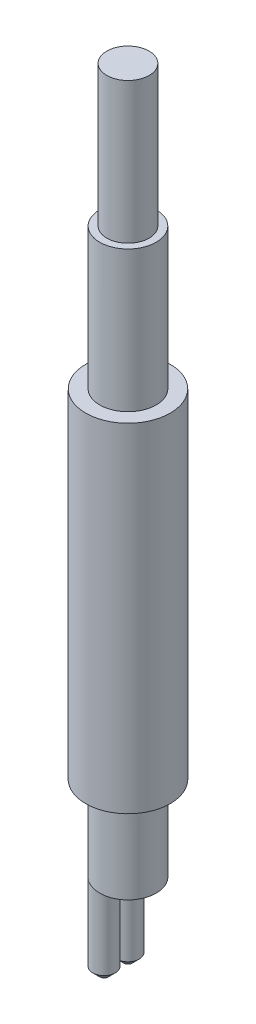
ISO-10303-21;
HEADER;
FILE_DESCRIPTION(('STEP AP214'),'2;1');
FILE_NAME('part.step','',(''),(''),'','','');
FILE_SCHEMA(('AUTOMOTIVE_DESIGN { 1 0 10303 214 1 1 1 1 }'));
ENDSEC;
DATA;
#1=APPLICATION_CONTEXT('core data for automotive mechanical design processes');
#2=APPLICATION_PROTOCOL_DEFINITION('international standard','automotive_design',2000,#1);
#3=PRODUCT_CONTEXT('',#1,'mechanical');
#4=PRODUCT('Part','Part','',(#3));
#5=PRODUCT_RELATED_PRODUCT_CATEGORY('part','',(#4));
#6=PRODUCT_DEFINITION_FORMATION('','',#4);
#7=PRODUCT_DEFINITION_CONTEXT('part definition',#1,'design');
#8=PRODUCT_DEFINITION('design','',#6,#7);
#9=PRODUCT_DEFINITION_SHAPE('','',#8);
#10=(LENGTH_UNIT() NAMED_UNIT(*) SI_UNIT(.MILLI.,.METRE.));
#11=(NAMED_UNIT(*) PLANE_ANGLE_UNIT() SI_UNIT($,.RADIAN.));
#12=(NAMED_UNIT(*) SI_UNIT($,.STERADIAN.) SOLID_ANGLE_UNIT());
#13=UNCERTAINTY_MEASURE_WITH_UNIT(LENGTH_MEASURE(1.E-05),#10,'distance_accuracy_value','');
#14=(GEOMETRIC_REPRESENTATION_CONTEXT(3) GLOBAL_UNCERTAINTY_ASSIGNED_CONTEXT((#13)) GLOBAL_UNIT_ASSIGNED_CONTEXT((#10,
#11,#12)) REPRESENTATION_CONTEXT('',''));
#15=CARTESIAN_POINT('',(0.,0.,0.));
#16=DIRECTION('',(0.,0.,1.));
#17=DIRECTION('',(1.,0.,0.));
#18=AXIS2_PLACEMENT_3D('',#15,#16,#17);
#19=CARTESIAN_POINT('',(0.,15.,0.));
#20=DIRECTION('',(0.,1.,0.));
#21=DIRECTION('',(0.,0.,1.));
#22=AXIS2_PLACEMENT_3D('',#19,#20,#21);
#23=PLANE('',#22);
#24=CARTESIAN_POINT('',(0.,15.,0.));
#25=DIRECTION('',(0.,1.,0.));
#26=DIRECTION('',(0.,0.,1.));
#27=AXIS2_PLACEMENT_3D('',#24,#25,#26);
#28=CIRCLE('',#27,1.5);
#29=CARTESIAN_POINT('',(0.,15.,1.5));
#30=VERTEX_POINT('',#29);
#31=EDGE_CURVE('E12',#30,#30,#28,.T.);
#32=ORIENTED_EDGE('',*,*,#31,.T.);
#33=EDGE_LOOP('',(#32));
#34=FACE_BOUND('',#33,.T.);
#35=CARTESIAN_POINT('',(0.,15.,0.));
#36=DIRECTION('',(0.,1.,0.));
#37=DIRECTION('',(1.,0.,0.));
#38=AXIS2_PLACEMENT_3D('',#35,#36,#37);
#39=CIRCLE('',#38,1.);
#40=CARTESIAN_POINT('',(1.,15.,0.));
#41=VERTEX_POINT('',#40);
#42=EDGE_CURVE('E62',#41,#41,#39,.T.);
#43=ORIENTED_EDGE('',*,*,#42,.F.);
#44=EDGE_LOOP('',(#43));
#45=FACE_BOUND('',#44,.T.);
#46=ADVANCED_FACE('F51',(#34,#45),#23,.T.);
#47=CARTESIAN_POINT('',(0.,3.,0.));
#48=DIRECTION('',(0.,1.,0.));
#49=DIRECTION('',(0.,0.,1.));
#50=AXIS2_PLACEMENT_3D('',#47,#48,#49);
#51=PLANE('',#50);
#52=CARTESIAN_POINT('',(0.,3.,0.));
#53=DIRECTION('',(0.,1.,0.));
#54=DIRECTION('',(0.,0.,1.));
#55=AXIS2_PLACEMENT_3D('',#52,#53,#54);
#56=CIRCLE('',#55,1.5);
#57=CARTESIAN_POINT('',(0.,3.,1.5));
#58=VERTEX_POINT('',#57);
#59=EDGE_CURVE('E55',#58,#58,#56,.T.);
#60=ORIENTED_EDGE('',*,*,#59,.F.);
#61=EDGE_LOOP('',(#60));
#62=FACE_BOUND('',#61,.T.);
#63=CARTESIAN_POINT('',(0.,3.,0.));
#64=DIRECTION('',(0.,1.,0.));
#65=DIRECTION('',(1.,0.,0.));
#66=AXIS2_PLACEMENT_3D('',#63,#64,#65);
#67=CIRCLE('',#66,1.);
#68=CARTESIAN_POINT('',(1.,3.,0.));
#69=VERTEX_POINT('',#68);
#70=EDGE_CURVE('E64',#69,#69,#67,.T.);
#71=ORIENTED_EDGE('',*,*,#70,.T.);
#72=EDGE_LOOP('',(#71));
#73=FACE_BOUND('',#72,.T.);
#74=ADVANCED_FACE('F74',(#62,#73),#51,.F.);
#75=CARTESIAN_POINT('',(0.,15.,0.));
#76=DIRECTION('',(0.,-1.,0.));
#77=DIRECTION('',(0.,0.,-1.));
#78=AXIS2_PLACEMENT_3D('',#75,#76,#77);
#79=CYLINDRICAL_SURFACE('',#78,1.5);
#80=ORIENTED_EDGE('',*,*,#31,.F.);
#81=EDGE_LOOP('',(#80));
#82=FACE_BOUND('',#81,.T.);
#83=ORIENTED_EDGE('',*,*,#59,.T.);
#84=EDGE_LOOP('',(#83));
#85=FACE_BOUND('',#84,.T.);
#86=ADVANCED_FACE('F53',(#82,#85),#79,.T.);
#87=CARTESIAN_POINT('',(0.,15.,0.));
#88=DIRECTION('',(0.,-1.,0.));
#89=DIRECTION('',(0.,0.,-1.));
#90=AXIS2_PLACEMENT_3D('',#87,#88,#89);
#91=CYLINDRICAL_SURFACE('',#90,1.);
#92=ORIENTED_EDGE('',*,*,#42,.T.);
#93=EDGE_LOOP('',(#92));
#94=FACE_BOUND('',#93,.T.);
#95=ORIENTED_EDGE('',*,*,#70,.F.);
#96=EDGE_LOOP('',(#95));
#97=FACE_BOUND('',#96,.T.);
#98=ADVANCED_FACE('F70',(#94,#97),#91,.F.);
#99=CLOSED_SHELL('',(#46,#74,#86,#98));
#100=MANIFOLD_SOLID_BREP('B2',#99);
#101=CARTESIAN_POINT('',(0.,-2.12132034355964,0.));
#102=DIRECTION('',(0.,1.,0.));
#103=DIRECTION('',(0.,0.,1.));
#104=AXIS2_PLACEMENT_3D('',#101,#102,#103);
#105=CYLINDRICAL_SURFACE('',#104,0.75);
#106=CARTESIAN_POINT('',(0.,0.,0.));
#107=DIRECTION('',(0.,1.,0.));
#108=DIRECTION('',(0.,0.,1.));
#109=AXIS2_PLACEMENT_3D('',#106,#107,#108);
#110=CIRCLE('',#109,0.75);
#111=CARTESIAN_POINT('',(0.,0.,0.75));
#112=VERTEX_POINT('',#111);
#113=EDGE_CURVE('E50',#112,#112,#110,.F.);
#114=ORIENTED_EDGE('',*,*,#113,.F.);
#115=EDGE_LOOP('',(#114));
#116=FACE_BOUND('',#115,.T.);
#117=CARTESIAN_POINT('',(0.,25.,0.));
#118=DIRECTION('',(0.,1.,0.));
#119=DIRECTION('',(0.,0.,1.));
#120=AXIS2_PLACEMENT_3D('',#117,#118,#119);
#121=CIRCLE('',#120,0.75);
#122=CARTESIAN_POINT('',(0.,25.,0.75));
#123=VERTEX_POINT('',#122);
#124=EDGE_CURVE('E135',#123,#123,#121,.T.);
#125=ORIENTED_EDGE('',*,*,#124,.F.);
#126=EDGE_LOOP('',(#125));
#127=FACE_BOUND('',#126,.T.);
#128=ADVANCED_FACE('F129',(#116,#127),#105,.T.);
#129=CARTESIAN_POINT('',(0.,0.,0.));
#130=DIRECTION('',(0.,1.,0.));
#131=DIRECTION('',(0.,0.,1.));
#132=AXIS2_PLACEMENT_3D('',#129,#130,#131);
#133=PLANE('',#132);
#134=ORIENTED_EDGE('',*,*,#113,.T.);
#135=EDGE_LOOP('',(#134));
#136=FACE_BOUND('',#135,.T.);
#137=ADVANCED_FACE('F144',(#136),#133,.F.);
#138=CARTESIAN_POINT('',(0.,25.,0.));
#139=DIRECTION('',(0.,1.,0.));
#140=DIRECTION('',(0.,0.,1.));
#141=AXIS2_PLACEMENT_3D('',#138,#139,#140);
#142=PLANE('',#141);
#143=ORIENTED_EDGE('',*,*,#124,.T.);
#144=EDGE_LOOP('',(#143));
#145=FACE_BOUND('',#144,.T.);
#146=ADVANCED_FACE('F141',(#145),#142,.T.);
#147=CLOSED_SHELL('',(#128,#137,#146));
#148=MANIFOLD_SOLID_BREP('B7',#147);
#149=CARTESIAN_POINT('',(0.,0.,0.));
#150=DIRECTION('',(0.,1.,0.));
#151=DIRECTION('',(0.,0.,1.));
#152=AXIS2_PLACEMENT_3D('',#149,#150,#151);
#153=PLANE('',#152);
#154=CARTESIAN_POINT('',(-0.424264068711929,0.,0.424264068711928));
#155=DIRECTION('',(0.,-1.,0.));
#156=DIRECTION('',(0.,0.,1.));
#157=AXIS2_PLACEMENT_3D('',#154,#155,#156);
#158=CIRCLE('',#157,0.4);
#159=CARTESIAN_POINT('',(-0.707106781186549,0.,0.707106781186546));
#160=VERTEX_POINT('',#159);
#161=CARTESIAN_POINT('',(-0.731039274218505,0.,0.167575593539398));
#162=VERTEX_POINT('',#161);
#163=EDGE_CURVE('E190',#160,#162,#158,.T.);
#164=ORIENTED_EDGE('',*,*,#163,.F.);
#165=CARTESIAN_POINT('',(0.,0.,0.));
#166=DIRECTION('',(0.,1.,0.));
#167=DIRECTION('',(0.,0.,1.));
#168=AXIS2_PLACEMENT_3D('',#165,#166,#167);
#169=CIRCLE('',#168,1.);
#170=CARTESIAN_POINT('',(-0.707106781186549,0.,-0.707106781186547));
#171=VERTEX_POINT('',#170);
#172=EDGE_CURVE('E245',#171,#160,#169,.T.);
#173=ORIENTED_EDGE('',*,*,#172,.F.);
#174=CARTESIAN_POINT('',(-0.424264068711929,0.,-0.424264068711928));
#175=DIRECTION('',(0.,-1.,0.));
#176=DIRECTION('',(0.,0.,-1.));
#177=AXIS2_PLACEMENT_3D('',#174,#175,#176);
#178=CIRCLE('',#177,0.4);
#179=CARTESIAN_POINT('',(-0.731039274218505,0.,-0.167575593539398));
#180=VERTEX_POINT('',#179);
#181=EDGE_CURVE('E237',#180,#171,#178,.T.);
#182=ORIENTED_EDGE('',*,*,#181,.F.);
#183=CARTESIAN_POINT('',(0.,0.,0.));
#184=DIRECTION('',(0.,1.,0.));
#185=DIRECTION('',(0.,0.,1.));
#186=AXIS2_PLACEMENT_3D('',#183,#184,#185);
#187=CIRCLE('',#186,0.75);
#188=EDGE_CURVE('E232',#180,#162,#187,.T.);
#189=ORIENTED_EDGE('',*,*,#188,.T.);
#190=EDGE_LOOP('',(#164,#173,#182,#189));
#191=FACE_BOUND('',#190,.T.);
#192=ADVANCED_FACE('F175',(#191),#153,.F.);
#193=CARTESIAN_POINT('',(0.,20.,0.));
#194=DIRECTION('',(0.,1.,0.));
#195=DIRECTION('',(0.,0.,1.));
#196=AXIS2_PLACEMENT_3D('',#193,#194,#195);
#197=PLANE('',#196);
#198=CARTESIAN_POINT('',(0.,20.,0.));
#199=DIRECTION('',(0.,1.,0.));
#200=DIRECTION('',(0.,0.,1.));
#201=AXIS2_PLACEMENT_3D('',#198,#199,#200);
#202=CIRCLE('',#201,1.);
#203=CARTESIAN_POINT('',(0.,20.,1.));
#204=VERTEX_POINT('',#203);
#205=EDGE_CURVE('E242',#204,#204,#202,.T.);
#206=ORIENTED_EDGE('',*,*,#205,.T.);
#207=EDGE_LOOP('',(#206));
#208=FACE_BOUND('',#207,.T.);
#209=CARTESIAN_POINT('',(0.,20.,0.));
#210=DIRECTION('',(0.,1.,0.));
#211=DIRECTION('',(0.,0.,1.));
#212=AXIS2_PLACEMENT_3D('',#209,#210,#211);
#213=CIRCLE('',#212,0.75);
#214=CARTESIAN_POINT('',(0.,20.,0.75));
#215=VERTEX_POINT('',#214);
#216=EDGE_CURVE('E239',#215,#215,#213,.T.);
#217=ORIENTED_EDGE('',*,*,#216,.F.);
#218=EDGE_LOOP('',(#217));
#219=FACE_BOUND('',#218,.T.);
#220=ADVANCED_FACE('F266',(#208,#219),#197,.T.);
#221=CARTESIAN_POINT('',(-0.167575593539401,0.,0.731039274218504));
#222=VERTEX_POINT('',#221);
#223=EDGE_CURVE('E221',#222,#160,#158,.T.);
#224=ORIENTED_EDGE('',*,*,#223,.F.);
#225=CARTESIAN_POINT('',(-0.167575593539401,0.,-0.731039274218504));
#226=VERTEX_POINT('',#225);
#227=EDGE_CURVE('E210',#222,#226,#187,.T.);
#228=ORIENTED_EDGE('',*,*,#227,.T.);
#229=EDGE_CURVE('E238',#171,#226,#178,.T.);
#230=ORIENTED_EDGE('',*,*,#229,.F.);
#231=EDGE_CURVE('E223',#160,#171,#169,.T.);
#232=ORIENTED_EDGE('',*,*,#231,.F.);
#233=EDGE_LOOP('',(#224,#228,#230,#232));
#234=FACE_BOUND('',#233,.T.);
#235=ADVANCED_FACE('F222',(#234),#153,.F.);
#236=CARTESIAN_POINT('',(0.,20.,0.));
#237=DIRECTION('',(0.,-1.,0.));
#238=DIRECTION('',(0.,0.,-1.));
#239=AXIS2_PLACEMENT_3D('',#236,#237,#238);
#240=CYLINDRICAL_SURFACE('',#239,1.);
#241=ORIENTED_EDGE('',*,*,#205,.F.);
#242=EDGE_LOOP('',(#241));
#243=FACE_BOUND('',#242,.T.);
#244=ORIENTED_EDGE('',*,*,#172,.T.);
#245=ORIENTED_EDGE('',*,*,#231,.T.);
#246=EDGE_LOOP('',(#244,#245));
#247=FACE_BOUND('',#246,.T.);
#248=ADVANCED_FACE('F275',(#243,#247),#240,.T.);
#249=CARTESIAN_POINT('',(0.,20.,0.));
#250=DIRECTION('',(0.,-1.,0.));
#251=DIRECTION('',(0.,0.,-1.));
#252=AXIS2_PLACEMENT_3D('',#249,#250,#251);
#253=CYLINDRICAL_SURFACE('',#252,0.75);
#254=ORIENTED_EDGE('',*,*,#216,.T.);
#255=EDGE_LOOP('',(#254));
#256=FACE_BOUND('',#255,.T.);
#257=EDGE_CURVE('E214',#226,#180,#187,.T.);
#258=ORIENTED_EDGE('',*,*,#257,.F.);
#259=ORIENTED_EDGE('',*,*,#227,.F.);
#260=EDGE_CURVE('E198',#162,#222,#187,.T.);
#261=ORIENTED_EDGE('',*,*,#260,.F.);
#262=ORIENTED_EDGE('',*,*,#188,.F.);
#263=EDGE_LOOP('',(#258,#259,#261,#262));
#264=FACE_BOUND('',#263,.T.);
#265=ADVANCED_FACE('F212',(#256,#264),#253,.F.);
#266=CARTESIAN_POINT('',(-0.424264068711929,0.,-0.424264068711928));
#267=DIRECTION('',(0.,-1.,0.));
#268=DIRECTION('',(0.,0.,-1.));
#269=AXIS2_PLACEMENT_3D('',#266,#267,#268);
#270=PLANE('',#269);
#271=EDGE_CURVE('E218',#226,#180,#178,.T.);
#272=ORIENTED_EDGE('',*,*,#271,.F.);
#273=ORIENTED_EDGE('',*,*,#257,.T.);
#274=EDGE_LOOP('',(#272,#273));
#275=FACE_BOUND('',#274,.T.);
#276=ADVANCED_FACE('F283',(#275),#270,.F.);
#277=CARTESIAN_POINT('',(-0.424264068711929,-3.,-0.424264068711928));
#278=DIRECTION('',(0.,1.,0.));
#279=DIRECTION('',(0.,0.,1.));
#280=AXIS2_PLACEMENT_3D('',#277,#278,#279);
#281=CYLINDRICAL_SURFACE('',#280,0.4);
#282=CARTESIAN_POINT('',(-0.424264068711929,-2.75,-0.424264068711928));
#283=DIRECTION('',(0.,-1.,0.));
#284=DIRECTION('',(0.,0.,-1.));
#285=AXIS2_PLACEMENT_3D('',#282,#283,#284);
#286=CIRCLE('',#285,0.4);
#287=CARTESIAN_POINT('',(-0.424264068711929,-2.75,-0.824264068711928));
#288=VERTEX_POINT('',#287);
#289=EDGE_CURVE('E250',#288,#288,#286,.F.);
#290=ORIENTED_EDGE('',*,*,#289,.T.);
#291=EDGE_LOOP('',(#290));
#292=FACE_BOUND('',#291,.T.);
#293=ORIENTED_EDGE('',*,*,#271,.T.);
#294=ORIENTED_EDGE('',*,*,#181,.T.);
#295=ORIENTED_EDGE('',*,*,#229,.T.);
#296=EDGE_LOOP('',(#293,#294,#295));
#297=FACE_BOUND('',#296,.T.);
#298=ADVANCED_FACE('F290',(#292,#297),#281,.T.);
#299=CARTESIAN_POINT('',(-0.424264068711929,-3.,-0.424264068711928));
#300=DIRECTION('',(0.,-1.,0.));
#301=DIRECTION('',(0.,0.,-1.));
#302=AXIS2_PLACEMENT_3D('',#299,#300,#301);
#303=PLANE('',#302);
#304=CARTESIAN_POINT('',(-0.424264068711929,-3.,-0.424264068711928));
#305=DIRECTION('',(0.,-1.,0.));
#306=DIRECTION('',(0.,0.,-1.));
#307=AXIS2_PLACEMENT_3D('',#304,#305,#306);
#308=CIRCLE('',#307,0.149999999999997);
#309=CARTESIAN_POINT('',(-0.424264068711929,-3.,-0.574264068711925));
#310=VERTEX_POINT('',#309);
#311=EDGE_CURVE('E247',#310,#310,#308,.T.);
#312=ORIENTED_EDGE('',*,*,#311,.T.);
#313=EDGE_LOOP('',(#312));
#314=FACE_BOUND('',#313,.T.);
#315=ADVANCED_FACE('F298',(#314),#303,.T.);
#316=CARTESIAN_POINT('',(-0.424264068711929,0.,0.424264068711928));
#317=DIRECTION('',(0.,1.,0.));
#318=DIRECTION('',(0.,0.,1.));
#319=AXIS2_PLACEMENT_3D('',#316,#317,#318);
#320=PLANE('',#319);
#321=EDGE_CURVE('E227',#162,#222,#158,.T.);
#322=ORIENTED_EDGE('',*,*,#321,.F.);
#323=ORIENTED_EDGE('',*,*,#260,.T.);
#324=EDGE_LOOP('',(#322,#323));
#325=FACE_BOUND('',#324,.T.);
#326=ADVANCED_FACE('F231',(#325),#320,.T.);
#327=CARTESIAN_POINT('',(-0.424264068711929,-3.,0.424264068711928));
#328=DIRECTION('',(0.,1.,0.));
#329=DIRECTION('',(0.,0.,1.));
#330=AXIS2_PLACEMENT_3D('',#327,#328,#329);
#331=CYLINDRICAL_SURFACE('',#330,0.4);
#332=CARTESIAN_POINT('',(-0.424264068711929,-2.75,0.424264068711928));
#333=DIRECTION('',(0.,1.,0.));
#334=DIRECTION('',(0.,0.,1.));
#335=AXIS2_PLACEMENT_3D('',#332,#333,#334);
#336=CIRCLE('',#335,0.4);
#337=CARTESIAN_POINT('',(-0.424264068711929,-2.75,0.824264068711928));
#338=VERTEX_POINT('',#337);
#339=EDGE_CURVE('E127',#338,#338,#336,.T.);
#340=ORIENTED_EDGE('',*,*,#339,.T.);
#341=EDGE_LOOP('',(#340));
#342=FACE_BOUND('',#341,.T.);
#343=ORIENTED_EDGE('',*,*,#163,.T.);
#344=ORIENTED_EDGE('',*,*,#321,.T.);
#345=ORIENTED_EDGE('',*,*,#223,.T.);
#346=EDGE_LOOP('',(#343,#344,#345));
#347=FACE_BOUND('',#346,.T.);
#348=ADVANCED_FACE('F233',(#342,#347),#331,.T.);
#349=CARTESIAN_POINT('',(-0.424264068711929,-3.,0.424264068711928));
#350=DIRECTION('',(0.,1.,0.));
#351=DIRECTION('',(0.,0.,1.));
#352=AXIS2_PLACEMENT_3D('',#349,#350,#351);
#353=PLANE('',#352);
#354=CARTESIAN_POINT('',(-0.424264068711929,-3.,0.424264068711928));
#355=DIRECTION('',(0.,1.,0.));
#356=DIRECTION('',(0.,0.,1.));
#357=AXIS2_PLACEMENT_3D('',#354,#355,#356);
#358=CIRCLE('',#357,0.149999999999997);
#359=CARTESIAN_POINT('',(-0.424264068711929,-3.,0.574264068711925));
#360=VERTEX_POINT('',#359);
#361=EDGE_CURVE('E183',#360,#360,#358,.F.);
#362=ORIENTED_EDGE('',*,*,#361,.T.);
#363=EDGE_LOOP('',(#362));
#364=FACE_BOUND('',#363,.T.);
#365=ADVANCED_FACE('F255',(#364),#353,.F.);
#366=CARTESIAN_POINT('',(-0.424264068711929,-3.,-0.424264068711928));
#367=DIRECTION('',(0.,1.,0.));
#368=DIRECTION('',(0.,0.,1.));
#369=AXIS2_PLACEMENT_3D('',#366,#367,#368);
#370=CONICAL_SURFACE('',#369,0.149999999999997,0.785398163397452);
#371=ORIENTED_EDGE('',*,*,#289,.F.);
#372=EDGE_LOOP('',(#371));
#373=FACE_BOUND('',#372,.T.);
#374=ORIENTED_EDGE('',*,*,#311,.F.);
#375=EDGE_LOOP('',(#374));
#376=FACE_BOUND('',#375,.T.);
#377=ADVANCED_FACE('F258',(#373,#376),#370,.T.);
#378=CARTESIAN_POINT('',(-0.424264068711929,-3.,0.424264068711928));
#379=DIRECTION('',(0.,1.,0.));
#380=DIRECTION('',(0.,0.,1.));
#381=AXIS2_PLACEMENT_3D('',#378,#379,#380);
#382=CONICAL_SURFACE('',#381,0.149999999999997,0.785398163397452);
#383=ORIENTED_EDGE('',*,*,#339,.F.);
#384=EDGE_LOOP('',(#383));
#385=FACE_BOUND('',#384,.T.);
#386=ORIENTED_EDGE('',*,*,#361,.F.);
#387=EDGE_LOOP('',(#386));
#388=FACE_BOUND('',#387,.T.);
#389=ADVANCED_FACE('F177',(#385,#388),#382,.T.);
#390=CLOSED_SHELL('',(#192,#220,#235,#248,#265,#276,#298,#315,#326,#348,#365,#377,#389));
#391=MANIFOLD_SOLID_BREP('B45',#390);
#392=ADVANCED_BREP_SHAPE_REPRESENTATION('',(#18,#100,#148,#391),#14);
#393=SHAPE_DEFINITION_REPRESENTATION(#9,#392);
ENDSEC;
END-ISO-10303-21;
